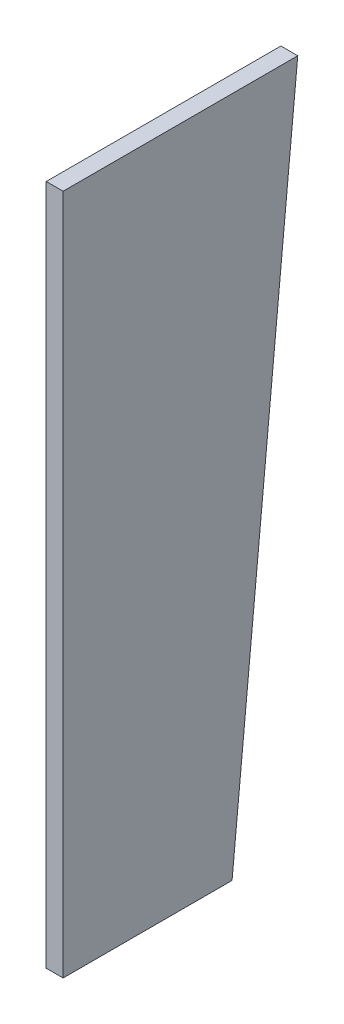
ISO-10303-21;
HEADER;
FILE_DESCRIPTION(('STEP AP214'),'2;1');
FILE_NAME('part.step','',(''),(''),'','','');
FILE_SCHEMA(('AUTOMOTIVE_DESIGN { 1 0 10303 214 1 1 1 1 }'));
ENDSEC;
DATA;
#1=APPLICATION_CONTEXT('core data for automotive mechanical design processes');
#2=APPLICATION_PROTOCOL_DEFINITION('international standard','automotive_design',2000,#1);
#3=PRODUCT_CONTEXT('',#1,'mechanical');
#4=PRODUCT('Part','Part','',(#3));
#5=PRODUCT_RELATED_PRODUCT_CATEGORY('part','',(#4));
#6=PRODUCT_DEFINITION_FORMATION('','',#4);
#7=PRODUCT_DEFINITION_CONTEXT('part definition',#1,'design');
#8=PRODUCT_DEFINITION('design','',#6,#7);
#9=PRODUCT_DEFINITION_SHAPE('','',#8);
#10=(LENGTH_UNIT() NAMED_UNIT(*) SI_UNIT(.MILLI.,.METRE.));
#11=(NAMED_UNIT(*) PLANE_ANGLE_UNIT() SI_UNIT($,.RADIAN.));
#12=(NAMED_UNIT(*) SI_UNIT($,.STERADIAN.) SOLID_ANGLE_UNIT());
#13=UNCERTAINTY_MEASURE_WITH_UNIT(LENGTH_MEASURE(1.E-05),#10,'distance_accuracy_value','');
#14=(GEOMETRIC_REPRESENTATION_CONTEXT(3) GLOBAL_UNCERTAINTY_ASSIGNED_CONTEXT((#13)) GLOBAL_UNIT_ASSIGNED_CONTEXT((#10,
#11,#12)) REPRESENTATION_CONTEXT('',''));
#15=CARTESIAN_POINT('',(0.,0.,0.));
#16=DIRECTION('',(0.,0.,1.));
#17=DIRECTION('',(1.,0.,0.));
#18=AXIS2_PLACEMENT_3D('',#15,#16,#17);
#19=CARTESIAN_POINT('',(18.,0.,-180.));
#20=DIRECTION('',(0.,1.,0.));
#21=DIRECTION('',(0.,0.,1.));
#22=AXIS2_PLACEMENT_3D('',#19,#20,#21);
#23=PLANE('',#22);
#24=DIRECTION('',(0.,0.,-1.));
#25=VECTOR('',#24,1.);
#26=CARTESIAN_POINT('',(0.,0.,-180.));
#27=LINE('',#26,#25);
#28=CARTESIAN_POINT('',(0.,0.,0.));
#29=VERTEX_POINT('',#28);
#30=CARTESIAN_POINT('',(0.,0.,-180.));
#31=VERTEX_POINT('',#30);
#32=EDGE_CURVE('E98',#29,#31,#27,.T.);
#33=ORIENTED_EDGE('',*,*,#32,.T.);
#34=DIRECTION('',(-1.,0.,0.));
#35=VECTOR('',#34,1.);
#36=CARTESIAN_POINT('',(18.,0.,-180.));
#37=LINE('',#36,#35);
#38=CARTESIAN_POINT('',(18.,0.,-180.));
#39=VERTEX_POINT('',#38);
#40=EDGE_CURVE('E11',#39,#31,#37,.T.);
#41=ORIENTED_EDGE('',*,*,#40,.F.);
#42=DIRECTION('',(0.,0.,-1.));
#43=VECTOR('',#42,1.);
#44=CARTESIAN_POINT('',(18.,0.,-180.));
#45=LINE('',#44,#43);
#46=CARTESIAN_POINT('',(18.,0.,0.));
#47=VERTEX_POINT('',#46);
#48=EDGE_CURVE('E86',#47,#39,#45,.T.);
#49=ORIENTED_EDGE('',*,*,#48,.F.);
#50=DIRECTION('',(-1.,0.,0.));
#51=VECTOR('',#50,1.);
#52=CARTESIAN_POINT('',(18.,0.,0.));
#53=LINE('',#52,#51);
#54=EDGE_CURVE('E94',#47,#29,#53,.T.);
#55=ORIENTED_EDGE('',*,*,#54,.T.);
#56=EDGE_LOOP('',(#33,#41,#49,#55));
#57=FACE_BOUND('',#56,.T.);
#58=ADVANCED_FACE('F35',(#57),#23,.F.);
#59=CARTESIAN_POINT('',(18.,726.,-250.));
#60=DIRECTION('',(0.,0.0959736518373695,0.995383874770432));
#61=DIRECTION('',(0.,-0.995383874770432,0.0959736518373695));
#62=AXIS2_PLACEMENT_3D('',#59,#60,#61);
#63=PLANE('',#62);
#64=DIRECTION('',(0.,0.995383874770432,-0.0959736518373695));
#65=VECTOR('',#64,1.);
#66=CARTESIAN_POINT('',(0.,726.,-250.));
#67=LINE('',#66,#65);
#68=CARTESIAN_POINT('',(0.,726.,-250.));
#69=VERTEX_POINT('',#68);
#70=EDGE_CURVE('E90',#31,#69,#67,.T.);
#71=ORIENTED_EDGE('',*,*,#70,.T.);
#72=DIRECTION('',(-1.,0.,0.));
#73=VECTOR('',#72,1.);
#74=CARTESIAN_POINT('',(18.,726.,-250.));
#75=LINE('',#74,#73);
#76=CARTESIAN_POINT('',(18.,726.,-250.));
#77=VERTEX_POINT('',#76);
#78=EDGE_CURVE('E43',#77,#69,#75,.T.);
#79=ORIENTED_EDGE('',*,*,#78,.F.);
#80=DIRECTION('',(0.,0.995383874770432,-0.0959736518373695));
#81=VECTOR('',#80,1.);
#82=CARTESIAN_POINT('',(18.,726.,-250.));
#83=LINE('',#82,#81);
#84=EDGE_CURVE('E81',#39,#77,#83,.T.);
#85=ORIENTED_EDGE('',*,*,#84,.F.);
#86=ORIENTED_EDGE('',*,*,#40,.T.);
#87=EDGE_LOOP('',(#71,#79,#85,#86));
#88=FACE_BOUND('',#87,.T.);
#89=ADVANCED_FACE('F89',(#88),#63,.F.);
#90=CARTESIAN_POINT('',(18.,726.,0.));
#91=DIRECTION('',(0.,-1.,0.));
#92=DIRECTION('',(0.,0.,-1.));
#93=AXIS2_PLACEMENT_3D('',#90,#91,#92);
#94=PLANE('',#93);
#95=DIRECTION('',(0.,0.,1.));
#96=VECTOR('',#95,1.);
#97=CARTESIAN_POINT('',(0.,726.,0.));
#98=LINE('',#97,#96);
#99=CARTESIAN_POINT('',(0.,726.,0.));
#100=VERTEX_POINT('',#99);
#101=EDGE_CURVE('E68',#69,#100,#98,.T.);
#102=ORIENTED_EDGE('',*,*,#101,.T.);
#103=DIRECTION('',(-1.,0.,0.));
#104=VECTOR('',#103,1.);
#105=CARTESIAN_POINT('',(18.,726.,0.));
#106=LINE('',#105,#104);
#107=CARTESIAN_POINT('',(18.,726.,0.));
#108=VERTEX_POINT('',#107);
#109=EDGE_CURVE('E91',#108,#100,#106,.T.);
#110=ORIENTED_EDGE('',*,*,#109,.F.);
#111=DIRECTION('',(0.,0.,1.));
#112=VECTOR('',#111,1.);
#113=CARTESIAN_POINT('',(18.,726.,0.));
#114=LINE('',#113,#112);
#115=EDGE_CURVE('E84',#77,#108,#114,.T.);
#116=ORIENTED_EDGE('',*,*,#115,.F.);
#117=ORIENTED_EDGE('',*,*,#78,.T.);
#118=EDGE_LOOP('',(#102,#110,#116,#117));
#119=FACE_BOUND('',#118,.T.);
#120=ADVANCED_FACE('F92',(#119),#94,.F.);
#121=CARTESIAN_POINT('',(18.,0.,0.));
#122=DIRECTION('',(0.,0.,-1.));
#123=DIRECTION('',(-1.,0.,0.));
#124=AXIS2_PLACEMENT_3D('',#121,#122,#123);
#125=PLANE('',#124);
#126=DIRECTION('',(0.,-1.,0.));
#127=VECTOR('',#126,1.);
#128=CARTESIAN_POINT('',(0.,0.,0.));
#129=LINE('',#128,#127);
#130=EDGE_CURVE('E74',#100,#29,#129,.T.);
#131=ORIENTED_EDGE('',*,*,#130,.T.);
#132=ORIENTED_EDGE('',*,*,#54,.F.);
#133=DIRECTION('',(0.,-1.,0.));
#134=VECTOR('',#133,1.);
#135=CARTESIAN_POINT('',(18.,0.,0.));
#136=LINE('',#135,#134);
#137=EDGE_CURVE('E51',#108,#47,#136,.T.);
#138=ORIENTED_EDGE('',*,*,#137,.F.);
#139=ORIENTED_EDGE('',*,*,#109,.T.);
#140=EDGE_LOOP('',(#131,#132,#138,#139));
#141=FACE_BOUND('',#140,.T.);
#142=ADVANCED_FACE('F105',(#141),#125,.F.);
#143=CARTESIAN_POINT('',(18.,0.,0.));
#144=DIRECTION('',(-1.,0.,0.));
#145=DIRECTION('',(0.,0.,1.));
#146=AXIS2_PLACEMENT_3D('',#143,#144,#145);
#147=PLANE('',#146);
#148=ORIENTED_EDGE('',*,*,#48,.T.);
#149=ORIENTED_EDGE('',*,*,#84,.T.);
#150=ORIENTED_EDGE('',*,*,#115,.T.);
#151=ORIENTED_EDGE('',*,*,#137,.T.);
#152=EDGE_LOOP('',(#148,#149,#150,#151));
#153=FACE_BOUND('',#152,.T.);
#154=ADVANCED_FACE('F82',(#153),#147,.F.);
#155=CARTESIAN_POINT('',(0.,0.,0.));
#156=DIRECTION('',(-1.,0.,0.));
#157=DIRECTION('',(0.,0.,1.));
#158=AXIS2_PLACEMENT_3D('',#155,#156,#157);
#159=PLANE('',#158);
#160=ORIENTED_EDGE('',*,*,#32,.F.);
#161=ORIENTED_EDGE('',*,*,#130,.F.);
#162=ORIENTED_EDGE('',*,*,#101,.F.);
#163=ORIENTED_EDGE('',*,*,#70,.F.);
#164=EDGE_LOOP('',(#160,#161,#162,#163));
#165=FACE_BOUND('',#164,.T.);
#166=ADVANCED_FACE('F108',(#165),#159,.T.);
#167=CLOSED_SHELL('',(#58,#89,#120,#142,#154,#166));
#168=MANIFOLD_SOLID_BREP('B2',#167);
#169=ADVANCED_BREP_SHAPE_REPRESENTATION('',(#18,#168),#14);
#170=SHAPE_DEFINITION_REPRESENTATION(#9,#169);
ENDSEC;
END-ISO-10303-21;
